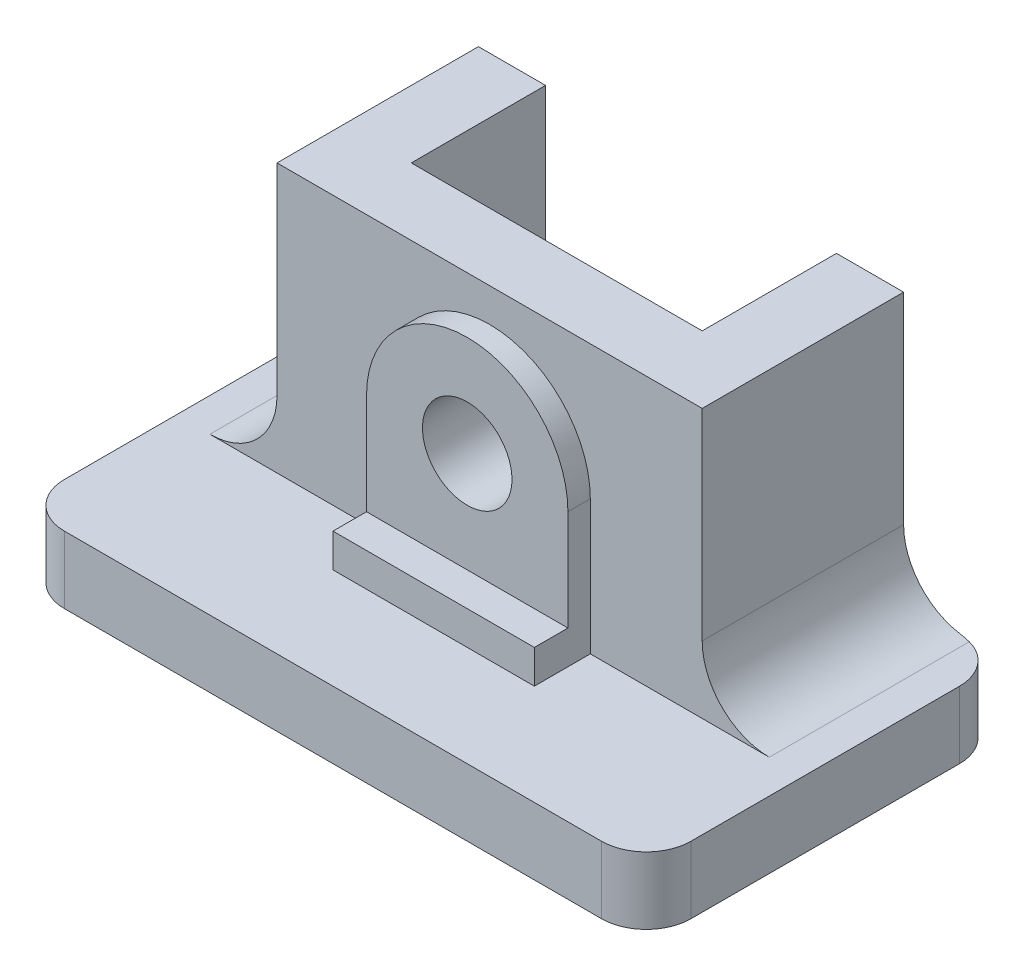
ISO-10303-21;
HEADER;
FILE_DESCRIPTION(('STEP AP214'),'2;1');
FILE_NAME('part.step','',(''),(''),'','','');
FILE_SCHEMA(('AUTOMOTIVE_DESIGN { 1 0 10303 214 1 1 1 1 }'));
ENDSEC;
DATA;
#1=APPLICATION_CONTEXT('core data for automotive mechanical design processes');
#2=APPLICATION_PROTOCOL_DEFINITION('international standard','automotive_design',2000,#1);
#3=PRODUCT_CONTEXT('',#1,'mechanical');
#4=PRODUCT('Part','Part','',(#3));
#5=PRODUCT_RELATED_PRODUCT_CATEGORY('part','',(#4));
#6=PRODUCT_DEFINITION_FORMATION('','',#4);
#7=PRODUCT_DEFINITION_CONTEXT('part definition',#1,'design');
#8=PRODUCT_DEFINITION('design','',#6,#7);
#9=PRODUCT_DEFINITION_SHAPE('','',#8);
#10=(LENGTH_UNIT() NAMED_UNIT(*) SI_UNIT(.MILLI.,.METRE.));
#11=(NAMED_UNIT(*) PLANE_ANGLE_UNIT() SI_UNIT($,.RADIAN.));
#12=(NAMED_UNIT(*) SI_UNIT($,.STERADIAN.) SOLID_ANGLE_UNIT());
#13=UNCERTAINTY_MEASURE_WITH_UNIT(LENGTH_MEASURE(1.E-05),#10,'distance_accuracy_value','');
#14=(GEOMETRIC_REPRESENTATION_CONTEXT(3) GLOBAL_UNCERTAINTY_ASSIGNED_CONTEXT((#13)) GLOBAL_UNIT_ASSIGNED_CONTEXT((#10,
#11,#12)) REPRESENTATION_CONTEXT('',''));
#15=CARTESIAN_POINT('',(0.,0.,0.));
#16=DIRECTION('',(0.,0.,1.));
#17=DIRECTION('',(1.,0.,0.));
#18=AXIS2_PLACEMENT_3D('',#15,#16,#17);
#19=CARTESIAN_POINT('',(0.,9.525,50.8));
#20=DIRECTION('',(0.,-1.,0.));
#21=DIRECTION('',(0.,0.,-1.));
#22=AXIS2_PLACEMENT_3D('',#19,#20,#21);
#23=PLANE('',#22);
#24=DIRECTION('',(0.,0.,-1.));
#25=VECTOR('',#24,1.);
#26=CARTESIAN_POINT('',(-84.1375,9.525,50.8));
#27=LINE('',#26,#25);
#28=CARTESIAN_POINT('',(-84.1375,9.525,28.575));
#29=VERTEX_POINT('',#28);
#30=CARTESIAN_POINT('',(-84.1375,9.525,0.201638937895729));
#31=VERTEX_POINT('',#30);
#32=EDGE_CURVE('E327',#29,#31,#27,.T.);
#33=ORIENTED_EDGE('',*,*,#32,.T.);
#34=CARTESIAN_POINT('',(-82.55,9.525,6.35));
#35=DIRECTION('',(0.,-1.,0.));
#36=DIRECTION('',(0.,0.,-1.));
#37=AXIS2_PLACEMENT_3D('',#34,#35,#36);
#38=CIRCLE('',#37,6.35);
#39=CARTESIAN_POINT('',(-88.9,9.525,6.35));
#40=VERTEX_POINT('',#39);
#41=EDGE_CURVE('E412',#31,#40,#38,.F.);
#42=ORIENTED_EDGE('',*,*,#41,.T.);
#43=DIRECTION('',(0.,0.,-1.));
#44=VECTOR('',#43,1.);
#45=CARTESIAN_POINT('',(-88.9,9.525,50.8));
#46=LINE('',#45,#44);
#47=CARTESIAN_POINT('',(-88.9,9.525,44.45));
#48=VERTEX_POINT('',#47);
#49=EDGE_CURVE('E324',#48,#40,#46,.T.);
#50=ORIENTED_EDGE('',*,*,#49,.F.);
#51=CARTESIAN_POINT('',(-82.55,9.525,44.45));
#52=DIRECTION('',(0.,-1.,0.));
#53=DIRECTION('',(0.,0.,-1.));
#54=AXIS2_PLACEMENT_3D('',#51,#52,#53);
#55=CIRCLE('',#54,6.35);
#56=CARTESIAN_POINT('',(-82.55,9.525,50.8));
#57=VERTEX_POINT('',#56);
#58=EDGE_CURVE('E414',#48,#57,#55,.F.);
#59=ORIENTED_EDGE('',*,*,#58,.T.);
#60=DIRECTION('',(-1.,0.,0.));
#61=VECTOR('',#60,1.);
#62=CARTESIAN_POINT('',(-88.9,9.525,50.8));
#63=LINE('',#62,#61);
#64=CARTESIAN_POINT('',(-6.34999999999999,9.525,50.8));
#65=VERTEX_POINT('',#64);
#66=EDGE_CURVE('E238',#65,#57,#63,.T.);
#67=ORIENTED_EDGE('',*,*,#66,.F.);
#68=CARTESIAN_POINT('',(-6.35,9.525,44.45));
#69=DIRECTION('',(0.,-1.,0.));
#70=DIRECTION('',(0.,0.,-1.));
#71=AXIS2_PLACEMENT_3D('',#68,#69,#70);
#72=CIRCLE('',#71,6.35);
#73=CARTESIAN_POINT('',(0.,9.525,44.45));
#74=VERTEX_POINT('',#73);
#75=EDGE_CURVE('E415',#65,#74,#72,.F.);
#76=ORIENTED_EDGE('',*,*,#75,.T.);
#77=DIRECTION('',(0.,0.,-1.));
#78=VECTOR('',#77,1.);
#79=CARTESIAN_POINT('',(0.,9.525,50.8));
#80=LINE('',#79,#78);
#81=CARTESIAN_POINT('',(0.,9.525,6.35));
#82=VERTEX_POINT('',#81);
#83=EDGE_CURVE('E339',#74,#82,#80,.T.);
#84=ORIENTED_EDGE('',*,*,#83,.T.);
#85=CARTESIAN_POINT('',(-6.35,9.525,6.35));
#86=DIRECTION('',(0.,-1.,0.));
#87=DIRECTION('',(0.,0.,-1.));
#88=AXIS2_PLACEMENT_3D('',#85,#86,#87);
#89=CIRCLE('',#88,6.35);
#90=CARTESIAN_POINT('',(-4.76249999999999,9.525,0.20163893789573));
#91=VERTEX_POINT('',#90);
#92=EDGE_CURVE('E58',#82,#91,#89,.F.);
#93=ORIENTED_EDGE('',*,*,#92,.T.);
#94=DIRECTION('',(0.,0.,-1.));
#95=VECTOR('',#94,1.);
#96=CARTESIAN_POINT('',(-4.76249999999999,9.525,50.8));
#97=LINE('',#96,#95);
#98=CARTESIAN_POINT('',(-4.76249999999999,9.525,28.575));
#99=VERTEX_POINT('',#98);
#100=EDGE_CURVE('E337',#99,#91,#97,.T.);
#101=ORIENTED_EDGE('',*,*,#100,.F.);
#102=DIRECTION('',(-1.,0.,0.));
#103=VECTOR('',#102,1.);
#104=CARTESIAN_POINT('',(-88.9,9.525,28.575));
#105=LINE('',#104,#103);
#106=CARTESIAN_POINT('',(-30.1625,9.525,28.575));
#107=VERTEX_POINT('',#106);
#108=EDGE_CURVE('E239',#99,#107,#105,.T.);
#109=ORIENTED_EDGE('',*,*,#108,.T.);
#110=DIRECTION('',(0.,0.,-1.));
#111=VECTOR('',#110,1.);
#112=CARTESIAN_POINT('',(-30.1625,9.52500000000001,31.75));
#113=LINE('',#112,#111);
#114=CARTESIAN_POINT('',(-30.1625,9.525,36.5125));
#115=VERTEX_POINT('',#114);
#116=EDGE_CURVE('E223',#115,#107,#113,.T.);
#117=ORIENTED_EDGE('',*,*,#116,.F.);
#118=DIRECTION('',(1.,0.,0.));
#119=VECTOR('',#118,1.);
#120=CARTESIAN_POINT('',(-58.7375,9.525,36.5125));
#121=LINE('',#120,#119);
#122=CARTESIAN_POINT('',(-58.7375,9.525,36.5125));
#123=VERTEX_POINT('',#122);
#124=EDGE_CURVE('E214',#123,#115,#121,.T.);
#125=ORIENTED_EDGE('',*,*,#124,.F.);
#126=DIRECTION('',(0.,0.,-1.));
#127=VECTOR('',#126,1.);
#128=CARTESIAN_POINT('',(-58.7375,9.525,31.75));
#129=LINE('',#128,#127);
#130=CARTESIAN_POINT('',(-58.7375,9.525,28.575));
#131=VERTEX_POINT('',#130);
#132=EDGE_CURVE('E199',#123,#131,#129,.T.);
#133=ORIENTED_EDGE('',*,*,#132,.T.);
#134=EDGE_CURVE('E234',#131,#29,#105,.T.);
#135=ORIENTED_EDGE('',*,*,#134,.T.);
#136=EDGE_LOOP('',(#33,#42,#50,#59,#67,#76,#84,#93,#101,#109,#117,#125,#133,#135));
#137=FACE_BOUND('',#136,.T.);
#138=ADVANCED_FACE('F35',(#137),#23,.F.);
#139=CARTESIAN_POINT('',(0.,0.,31.75));
#140=DIRECTION('',(0.,0.,1.));
#141=DIRECTION('',(1.,0.,0.));
#142=AXIS2_PLACEMENT_3D('',#139,#140,#141);
#143=PLANE('',#142);
#144=CARTESIAN_POINT('',(-44.45,28.575,31.75));
#145=DIRECTION('',(0.,0.,1.));
#146=DIRECTION('',(1.,0.,0.));
#147=AXIS2_PLACEMENT_3D('',#144,#145,#146);
#148=CIRCLE('',#147,6.35);
#149=CARTESIAN_POINT('',(-38.1,28.575,31.75));
#150=VERTEX_POINT('',#149);
#151=EDGE_CURVE('E209',#150,#150,#148,.T.);
#152=ORIENTED_EDGE('',*,*,#151,.F.);
#153=EDGE_LOOP('',(#152));
#154=FACE_BOUND('',#153,.T.);
#155=DIRECTION('',(0.,-1.,0.));
#156=VECTOR('',#155,1.);
#157=CARTESIAN_POINT('',(-58.7375,0.,31.75));
#158=LINE('',#157,#156);
#159=CARTESIAN_POINT('',(-58.7375,28.575,31.75));
#160=VERTEX_POINT('',#159);
#161=CARTESIAN_POINT('',(-58.7375,14.2875,31.75));
#162=VERTEX_POINT('',#161);
#163=EDGE_CURVE('E249',#160,#162,#158,.T.);
#164=ORIENTED_EDGE('',*,*,#163,.T.);
#165=DIRECTION('',(-1.,0.,0.));
#166=VECTOR('',#165,1.);
#167=CARTESIAN_POINT('',(-58.7375,14.2875,31.75));
#168=LINE('',#167,#166);
#169=CARTESIAN_POINT('',(-30.1625,14.2875,31.75));
#170=VERTEX_POINT('',#169);
#171=EDGE_CURVE('E219',#170,#162,#168,.T.);
#172=ORIENTED_EDGE('',*,*,#171,.F.);
#173=DIRECTION('',(0.,-1.,0.));
#174=VECTOR('',#173,1.);
#175=CARTESIAN_POINT('',(-30.1625,0.,31.75));
#176=LINE('',#175,#174);
#177=CARTESIAN_POINT('',(-30.1625,28.575,31.75));
#178=VERTEX_POINT('',#177);
#179=EDGE_CURVE('E244',#178,#170,#176,.T.);
#180=ORIENTED_EDGE('',*,*,#179,.F.);
#181=CARTESIAN_POINT('',(-44.45,28.575,31.75));
#182=DIRECTION('',(0.,0.,1.));
#183=DIRECTION('',(1.,0.,0.));
#184=AXIS2_PLACEMENT_3D('',#181,#182,#183);
#185=CIRCLE('',#184,14.2875);
#186=EDGE_CURVE('E247',#178,#160,#185,.T.);
#187=ORIENTED_EDGE('',*,*,#186,.T.);
#188=EDGE_LOOP('',(#164,#172,#180,#187));
#189=FACE_BOUND('',#188,.T.);
#190=ADVANCED_FACE('F477',(#154,#189),#143,.T.);
#191=CARTESIAN_POINT('',(-88.9,0.,28.575));
#192=DIRECTION('',(0.,0.,-1.));
#193=DIRECTION('',(-1.,0.,0.));
#194=AXIS2_PLACEMENT_3D('',#191,#192,#193);
#195=PLANE('',#194);
#196=ORIENTED_EDGE('',*,*,#108,.F.);
#197=CARTESIAN_POINT('',(-4.76249999999999,19.05,28.575));
#198=DIRECTION('',(0.,0.,-1.));
#199=DIRECTION('',(-1.,0.,0.));
#200=AXIS2_PLACEMENT_3D('',#197,#198,#199);
#201=CIRCLE('',#200,9.525);
#202=CARTESIAN_POINT('',(-14.2875,19.05,28.575));
#203=VERTEX_POINT('',#202);
#204=EDGE_CURVE('E275',#99,#203,#201,.T.);
#205=ORIENTED_EDGE('',*,*,#204,.T.);
#206=DIRECTION('',(0.,1.,0.));
#207=VECTOR('',#206,1.);
#208=CARTESIAN_POINT('',(-14.2875,0.,28.575));
#209=LINE('',#208,#207);
#210=CARTESIAN_POINT('',(-14.2875,47.625,28.575));
#211=VERTEX_POINT('',#210);
#212=EDGE_CURVE('E273',#203,#211,#209,.T.);
#213=ORIENTED_EDGE('',*,*,#212,.T.);
#214=DIRECTION('',(-1.,0.,0.));
#215=VECTOR('',#214,1.);
#216=CARTESIAN_POINT('',(-88.9,47.625,28.575));
#217=LINE('',#216,#215);
#218=CARTESIAN_POINT('',(-74.6125,47.625,28.575));
#219=VERTEX_POINT('',#218);
#220=EDGE_CURVE('E265',#211,#219,#217,.T.);
#221=ORIENTED_EDGE('',*,*,#220,.T.);
#222=DIRECTION('',(0.,1.,0.));
#223=VECTOR('',#222,1.);
#224=CARTESIAN_POINT('',(-74.6125,0.,28.575));
#225=LINE('',#224,#223);
#226=CARTESIAN_POINT('',(-74.6125,19.05,28.575));
#227=VERTEX_POINT('',#226);
#228=EDGE_CURVE('E270',#227,#219,#225,.T.);
#229=ORIENTED_EDGE('',*,*,#228,.F.);
#230=CARTESIAN_POINT('',(-84.1375,19.05,28.575));
#231=DIRECTION('',(0.,0.,-1.));
#232=DIRECTION('',(-1.,0.,0.));
#233=AXIS2_PLACEMENT_3D('',#230,#231,#232);
#234=CIRCLE('',#233,9.525);
#235=EDGE_CURVE('E267',#29,#227,#234,.F.);
#236=ORIENTED_EDGE('',*,*,#235,.F.);
#237=ORIENTED_EDGE('',*,*,#134,.F.);
#238=DIRECTION('',(0.,-1.,0.));
#239=VECTOR('',#238,1.);
#240=CARTESIAN_POINT('',(-58.7375,0.,28.575));
#241=LINE('',#240,#239);
#242=CARTESIAN_POINT('',(-58.7375,28.575,28.575));
#243=VERTEX_POINT('',#242);
#244=EDGE_CURVE('E205',#243,#131,#241,.T.);
#245=ORIENTED_EDGE('',*,*,#244,.F.);
#246=CARTESIAN_POINT('',(-44.45,28.575,28.575));
#247=DIRECTION('',(0.,0.,1.));
#248=DIRECTION('',(1.,0.,0.));
#249=AXIS2_PLACEMENT_3D('',#246,#247,#248);
#250=CIRCLE('',#249,14.2875);
#251=CARTESIAN_POINT('',(-30.1625,28.575,28.575));
#252=VERTEX_POINT('',#251);
#253=EDGE_CURVE('E256',#252,#243,#250,.T.);
#254=ORIENTED_EDGE('',*,*,#253,.F.);
#255=DIRECTION('',(0.,-1.,0.));
#256=VECTOR('',#255,1.);
#257=CARTESIAN_POINT('',(-30.1625,0.,28.575));
#258=LINE('',#257,#256);
#259=EDGE_CURVE('E242',#252,#107,#258,.T.);
#260=ORIENTED_EDGE('',*,*,#259,.T.);
#261=EDGE_LOOP('',(#196,#205,#213,#221,#229,#236,#237,#245,#254,#260));
#262=FACE_BOUND('',#261,.T.);
#263=ADVANCED_FACE('F481',(#262),#195,.F.);
#264=CARTESIAN_POINT('',(0.,0.,0.));
#265=DIRECTION('',(0.,0.,1.));
#266=DIRECTION('',(1.,0.,0.));
#267=AXIS2_PLACEMENT_3D('',#264,#265,#266);
#268=PLANE('',#267);
#269=DIRECTION('',(1.,0.,0.));
#270=VECTOR('',#269,1.);
#271=CARTESIAN_POINT('',(0.,0.,0.));
#272=LINE('',#271,#270);
#273=CARTESIAN_POINT('',(-82.55,0.,0.));
#274=VERTEX_POINT('',#273);
#275=CARTESIAN_POINT('',(-65.0875,0.,0.));
#276=VERTEX_POINT('',#275);
#277=EDGE_CURVE('E304',#274,#276,#272,.T.);
#278=ORIENTED_EDGE('',*,*,#277,.F.);
#279=DIRECTION('',(0.,-1.,0.));
#280=VECTOR('',#279,1.);
#281=CARTESIAN_POINT('',(-82.55,0.,0.));
#282=LINE('',#281,#280);
#283=CARTESIAN_POINT('',(-82.55,9.65822334432936,0.));
#284=VERTEX_POINT('',#283);
#285=EDGE_CURVE('E357',#274,#284,#282,.F.);
#286=ORIENTED_EDGE('',*,*,#285,.T.);
#287=CARTESIAN_POINT('',(-84.1375,19.05,0.));
#288=DIRECTION('',(0.,0.,1.));
#289=DIRECTION('',(1.,0.,0.));
#290=AXIS2_PLACEMENT_3D('',#287,#288,#289);
#291=CIRCLE('',#290,9.525);
#292=CARTESIAN_POINT('',(-74.6125,19.05,0.));
#293=VERTEX_POINT('',#292);
#294=EDGE_CURVE('E318',#293,#284,#291,.F.);
#295=ORIENTED_EDGE('',*,*,#294,.F.);
#296=DIRECTION('',(0.,-1.,0.));
#297=VECTOR('',#296,1.);
#298=CARTESIAN_POINT('',(-74.6125,0.,0.));
#299=LINE('',#298,#297);
#300=CARTESIAN_POINT('',(-74.6125,47.625,0.));
#301=VERTEX_POINT('',#300);
#302=EDGE_CURVE('E315',#301,#293,#299,.T.);
#303=ORIENTED_EDGE('',*,*,#302,.F.);
#304=DIRECTION('',(1.,0.,0.));
#305=VECTOR('',#304,1.);
#306=CARTESIAN_POINT('',(0.,47.625,0.));
#307=LINE('',#306,#305);
#308=CARTESIAN_POINT('',(-65.0875,47.625,0.));
#309=VERTEX_POINT('',#308);
#310=EDGE_CURVE('E312',#301,#309,#307,.T.);
#311=ORIENTED_EDGE('',*,*,#310,.T.);
#312=DIRECTION('',(0.,1.,0.));
#313=VECTOR('',#312,1.);
#314=CARTESIAN_POINT('',(-65.0875,0.,0.));
#315=LINE('',#314,#313);
#316=EDGE_CURVE('E295',#276,#309,#315,.T.);
#317=ORIENTED_EDGE('',*,*,#316,.F.);
#318=EDGE_LOOP('',(#278,#286,#295,#303,#311,#317));
#319=FACE_BOUND('',#318,.T.);
#320=ADVANCED_FACE('F448',(#319),#268,.F.);
#321=CARTESIAN_POINT('',(0.,0.,50.8));
#322=DIRECTION('',(0.,1.,0.));
#323=DIRECTION('',(0.,0.,1.));
#324=AXIS2_PLACEMENT_3D('',#321,#322,#323);
#325=PLANE('',#324);
#326=DIRECTION('',(0.,0.,-1.));
#327=VECTOR('',#326,1.);
#328=CARTESIAN_POINT('',(-88.9,0.,50.8));
#329=LINE('',#328,#327);
#330=CARTESIAN_POINT('',(-88.9,0.,44.45));
#331=VERTEX_POINT('',#330);
#332=CARTESIAN_POINT('',(-88.9,0.,6.35));
#333=VERTEX_POINT('',#332);
#334=EDGE_CURVE('E321',#331,#333,#329,.T.);
#335=ORIENTED_EDGE('',*,*,#334,.T.);
#336=CARTESIAN_POINT('',(-82.55,0.,6.35));
#337=DIRECTION('',(0.,1.,0.));
#338=DIRECTION('',(0.,0.,1.));
#339=AXIS2_PLACEMENT_3D('',#336,#337,#338);
#340=CIRCLE('',#339,6.35);
#341=EDGE_CURVE('E355',#333,#274,#340,.F.);
#342=ORIENTED_EDGE('',*,*,#341,.T.);
#343=ORIENTED_EDGE('',*,*,#277,.T.);
#344=DIRECTION('',(0.,0.,1.));
#345=VECTOR('',#344,1.);
#346=CARTESIAN_POINT('',(-65.0875,0.,0.));
#347=LINE('',#346,#345);
#348=CARTESIAN_POINT('',(-65.0875,0.,19.05));
#349=VERTEX_POINT('',#348);
#350=EDGE_CURVE('E278',#276,#349,#347,.T.);
#351=ORIENTED_EDGE('',*,*,#350,.T.);
#352=DIRECTION('',(1.,0.,0.));
#353=VECTOR('',#352,1.);
#354=CARTESIAN_POINT('',(-65.0875,0.,19.05));
#355=LINE('',#354,#353);
#356=CARTESIAN_POINT('',(-23.8125,0.,19.05));
#357=VERTEX_POINT('',#356);
#358=EDGE_CURVE('E281',#349,#357,#355,.T.);
#359=ORIENTED_EDGE('',*,*,#358,.T.);
#360=DIRECTION('',(0.,0.,-1.));
#361=VECTOR('',#360,1.);
#362=CARTESIAN_POINT('',(-23.8125,0.,0.));
#363=LINE('',#362,#361);
#364=CARTESIAN_POINT('',(-23.8125,0.,0.));
#365=VERTEX_POINT('',#364);
#366=EDGE_CURVE('E285',#357,#365,#363,.T.);
#367=ORIENTED_EDGE('',*,*,#366,.T.);
#368=CARTESIAN_POINT('',(-6.35,0.,0.));
#369=VERTEX_POINT('',#368);
#370=EDGE_CURVE('E297',#365,#369,#272,.T.);
#371=ORIENTED_EDGE('',*,*,#370,.T.);
#372=CARTESIAN_POINT('',(-6.35,0.,6.35));
#373=DIRECTION('',(0.,1.,0.));
#374=DIRECTION('',(0.,0.,1.));
#375=AXIS2_PLACEMENT_3D('',#372,#373,#374);
#376=CIRCLE('',#375,6.35);
#377=CARTESIAN_POINT('',(0.,0.,6.35));
#378=VERTEX_POINT('',#377);
#379=EDGE_CURVE('E349',#369,#378,#376,.F.);
#380=ORIENTED_EDGE('',*,*,#379,.T.);
#381=DIRECTION('',(0.,0.,-1.));
#382=VECTOR('',#381,1.);
#383=CARTESIAN_POINT('',(0.,0.,50.8));
#384=LINE('',#383,#382);
#385=CARTESIAN_POINT('',(0.,0.,44.45));
#386=VERTEX_POINT('',#385);
#387=EDGE_CURVE('E341',#386,#378,#384,.T.);
#388=ORIENTED_EDGE('',*,*,#387,.F.);
#389=CARTESIAN_POINT('',(-6.35,0.,44.45));
#390=DIRECTION('',(0.,1.,0.));
#391=DIRECTION('',(0.,0.,1.));
#392=AXIS2_PLACEMENT_3D('',#389,#390,#391);
#393=CIRCLE('',#392,6.35);
#394=CARTESIAN_POINT('',(-6.34999999999999,0.,50.8));
#395=VERTEX_POINT('',#394);
#396=EDGE_CURVE('E351',#386,#395,#393,.F.);
#397=ORIENTED_EDGE('',*,*,#396,.T.);
#398=DIRECTION('',(1.,0.,0.));
#399=VECTOR('',#398,1.);
#400=CARTESIAN_POINT('',(-88.9,0.,50.8));
#401=LINE('',#400,#399);
#402=CARTESIAN_POINT('',(-82.55,0.,50.8));
#403=VERTEX_POINT('',#402);
#404=EDGE_CURVE('E235',#403,#395,#401,.T.);
#405=ORIENTED_EDGE('',*,*,#404,.F.);
#406=CARTESIAN_POINT('',(-82.55,0.,44.45));
#407=DIRECTION('',(0.,1.,0.));
#408=DIRECTION('',(0.,0.,1.));
#409=AXIS2_PLACEMENT_3D('',#406,#407,#408);
#410=CIRCLE('',#409,6.35);
#411=EDGE_CURVE('E353',#403,#331,#410,.F.);
#412=ORIENTED_EDGE('',*,*,#411,.T.);
#413=EDGE_LOOP('',(#335,#342,#343,#351,#359,#367,#371,#380,#388,#397,#405,#412));
#414=FACE_BOUND('',#413,.T.);
#415=ADVANCED_FACE('F428',(#414),#325,.F.);
#416=CARTESIAN_POINT('',(0.,0.,50.8));
#417=DIRECTION('',(1.,0.,0.));
#418=DIRECTION('',(0.,1.,0.));
#419=AXIS2_PLACEMENT_3D('',#416,#417,#418);
#420=PLANE('',#419);
#421=ORIENTED_EDGE('',*,*,#83,.F.);
#422=DIRECTION('',(0.,1.,0.));
#423=VECTOR('',#422,1.);
#424=CARTESIAN_POINT('',(0.,0.,44.45));
#425=LINE('',#424,#423);
#426=EDGE_CURVE('E402',#74,#386,#425,.F.);
#427=ORIENTED_EDGE('',*,*,#426,.T.);
#428=ORIENTED_EDGE('',*,*,#387,.T.);
#429=DIRECTION('',(0.,-1.,0.));
#430=VECTOR('',#429,1.);
#431=CARTESIAN_POINT('',(0.,9.525,6.35));
#432=LINE('',#431,#430);
#433=EDGE_CURVE('E404',#378,#82,#432,.F.);
#434=ORIENTED_EDGE('',*,*,#433,.T.);
#435=EDGE_LOOP('',(#421,#427,#428,#434));
#436=FACE_BOUND('',#435,.T.);
#437=ADVANCED_FACE('F395',(#436),#420,.T.);
#438=CARTESIAN_POINT('',(-4.76249999999999,19.05,50.8));
#439=DIRECTION('',(0.,0.,-1.));
#440=DIRECTION('',(-1.,0.,0.));
#441=AXIS2_PLACEMENT_3D('',#438,#439,#440);
#442=CYLINDRICAL_SURFACE('',#441,9.525);
#443=ORIENTED_EDGE('',*,*,#100,.T.);
#444=CARTESIAN_POINT('',(-4.76249999999999,9.525,0.20163893789573));
#445=CARTESIAN_POINT('',(-4.89292842954271,9.52498377923927,0.167946005353614));
#446=CARTESIAN_POINT('',(-5.02444082954333,9.52767904090494,0.138433284963938));
#447=CARTESIAN_POINT('',(-5.28809556049949,9.53860645353962,0.087993903837918));
#448=CARTESIAN_POINT('',(-5.42023003054187,9.54680696328974,0.0670192712376514));
#449=CARTESIAN_POINT('',(-5.68509533288884,9.56885549900046,0.033496104243662));
#450=CARTESIAN_POINT('',(-5.81782616525393,9.58270352553383,0.0209475707045315));
#451=CARTESIAN_POINT('',(-6.08386751021251,9.61613702105669,0.00416749227032797));
#452=CARTESIAN_POINT('',(-6.21717698515402,9.63575491851342,-1.59727596285902E-05));
#453=CARTESIAN_POINT('',(-6.35,9.65822334432936,0.));
#454=B_SPLINE_CURVE_WITH_KNOTS('',3,(#444,#445,#446,#447,#448,#449,#450,#451,#452,#453),
.UNSPECIFIED.,.F.,.F.,(4,2,2,2,4),(0.,0.404040283946994,0.805778018629562,1.20751579405719,
1.61155607371614),.UNSPECIFIED.);
#455=CARTESIAN_POINT('',(-6.35,9.65822334432936,0.));
#456=VERTEX_POINT('',#455);
#457=EDGE_CURVE('E11',#91,#456,#454,.T.);
#458=ORIENTED_EDGE('',*,*,#457,.T.);
#459=CARTESIAN_POINT('',(-4.76249999999999,19.05,0.));
#460=DIRECTION('',(0.,0.,1.));
#461=DIRECTION('',(1.,0.,0.));
#462=AXIS2_PLACEMENT_3D('',#459,#460,#461);
#463=CIRCLE('',#462,9.525);
#464=CARTESIAN_POINT('',(-14.2875,19.05,0.));
#465=VERTEX_POINT('',#464);
#466=EDGE_CURVE('E306',#465,#456,#463,.T.);
#467=ORIENTED_EDGE('',*,*,#466,.F.);
#468=DIRECTION('',(0.,0.,-1.));
#469=VECTOR('',#468,1.);
#470=CARTESIAN_POINT('',(-14.2875,19.05,50.8));
#471=LINE('',#470,#469);
#472=EDGE_CURVE('E335',#203,#465,#471,.T.);
#473=ORIENTED_EDGE('',*,*,#472,.F.);
#474=ORIENTED_EDGE('',*,*,#204,.F.);
#475=EDGE_LOOP('',(#443,#458,#467,#473,#474));
#476=FACE_BOUND('',#475,.T.);
#477=ADVANCED_FACE('F390',(#476),#442,.F.);
#478=CARTESIAN_POINT('',(-14.2875,0.,50.8));
#479=DIRECTION('',(1.,0.,0.));
#480=DIRECTION('',(0.,1.,0.));
#481=AXIS2_PLACEMENT_3D('',#478,#479,#480);
#482=PLANE('',#481);
#483=ORIENTED_EDGE('',*,*,#212,.F.);
#484=ORIENTED_EDGE('',*,*,#472,.T.);
#485=DIRECTION('',(0.,-1.,0.));
#486=VECTOR('',#485,1.);
#487=CARTESIAN_POINT('',(-14.2875,0.,0.));
#488=LINE('',#487,#486);
#489=CARTESIAN_POINT('',(-14.2875,47.625,0.));
#490=VERTEX_POINT('',#489);
#491=EDGE_CURVE('E308',#490,#465,#488,.T.);
#492=ORIENTED_EDGE('',*,*,#491,.F.);
#493=DIRECTION('',(0.,0.,-1.));
#494=VECTOR('',#493,1.);
#495=CARTESIAN_POINT('',(-14.2875,47.625,50.8));
#496=LINE('',#495,#494);
#497=EDGE_CURVE('E333',#211,#490,#496,.T.);
#498=ORIENTED_EDGE('',*,*,#497,.F.);
#499=EDGE_LOOP('',(#483,#484,#492,#498));
#500=FACE_BOUND('',#499,.T.);
#501=ADVANCED_FACE('F386',(#500),#482,.T.);
#502=CARTESIAN_POINT('',(0.,47.625,50.8));
#503=DIRECTION('',(0.,1.,0.));
#504=DIRECTION('',(0.,0.,1.));
#505=AXIS2_PLACEMENT_3D('',#502,#503,#504);
#506=PLANE('',#505);
#507=ORIENTED_EDGE('',*,*,#220,.F.);
#508=ORIENTED_EDGE('',*,*,#497,.T.);
#509=CARTESIAN_POINT('',(-23.8125,47.625,0.));
#510=VERTEX_POINT('',#509);
#511=EDGE_CURVE('E311',#510,#490,#307,.T.);
#512=ORIENTED_EDGE('',*,*,#511,.F.);
#513=DIRECTION('',(0.,0.,-1.));
#514=VECTOR('',#513,1.);
#515=CARTESIAN_POINT('',(-23.8125,47.625,0.));
#516=LINE('',#515,#514);
#517=CARTESIAN_POINT('',(-23.8125,47.625,19.05));
#518=VERTEX_POINT('',#517);
#519=EDGE_CURVE('E282',#518,#510,#516,.T.);
#520=ORIENTED_EDGE('',*,*,#519,.F.);
#521=DIRECTION('',(1.,0.,0.));
#522=VECTOR('',#521,1.);
#523=CARTESIAN_POINT('',(-65.0875,47.625,19.05));
#524=LINE('',#523,#522);
#525=CARTESIAN_POINT('',(-65.0875,47.625,19.05));
#526=VERTEX_POINT('',#525);
#527=EDGE_CURVE('E291',#526,#518,#524,.T.);
#528=ORIENTED_EDGE('',*,*,#527,.F.);
#529=DIRECTION('',(0.,0.,1.));
#530=VECTOR('',#529,1.);
#531=CARTESIAN_POINT('',(-65.0875,47.625,0.));
#532=LINE('',#531,#530);
#533=EDGE_CURVE('E277',#309,#526,#532,.T.);
#534=ORIENTED_EDGE('',*,*,#533,.F.);
#535=ORIENTED_EDGE('',*,*,#310,.F.);
#536=DIRECTION('',(0.,0.,-1.));
#537=VECTOR('',#536,1.);
#538=CARTESIAN_POINT('',(-74.6125,47.625,50.8));
#539=LINE('',#538,#537);
#540=EDGE_CURVE('E331',#219,#301,#539,.T.);
#541=ORIENTED_EDGE('',*,*,#540,.F.);
#542=EDGE_LOOP('',(#507,#508,#512,#520,#528,#534,#535,#541));
#543=FACE_BOUND('',#542,.T.);
#544=ADVANCED_FACE('F382',(#543),#506,.T.);
#545=CARTESIAN_POINT('',(-74.6125,0.,50.8));
#546=DIRECTION('',(1.,0.,0.));
#547=DIRECTION('',(0.,0.,-1.));
#548=AXIS2_PLACEMENT_3D('',#545,#546,#547);
#549=PLANE('',#548);
#550=DIRECTION('',(0.,0.,-1.));
#551=VECTOR('',#550,1.);
#552=CARTESIAN_POINT('',(-74.6125,19.05,50.8));
#553=LINE('',#552,#551);
#554=EDGE_CURVE('E329',#227,#293,#553,.T.);
#555=ORIENTED_EDGE('',*,*,#554,.F.);
#556=ORIENTED_EDGE('',*,*,#228,.T.);
#557=ORIENTED_EDGE('',*,*,#540,.T.);
#558=ORIENTED_EDGE('',*,*,#302,.T.);
#559=EDGE_LOOP('',(#555,#556,#557,#558));
#560=FACE_BOUND('',#559,.T.);
#561=ADVANCED_FACE('F377',(#560),#549,.F.);
#562=CARTESIAN_POINT('',(-84.1375,19.05,50.8));
#563=DIRECTION('',(0.,0.,-1.));
#564=DIRECTION('',(-1.,0.,0.));
#565=AXIS2_PLACEMENT_3D('',#562,#563,#564);
#566=CYLINDRICAL_SURFACE('',#565,9.525);
#567=ORIENTED_EDGE('',*,*,#294,.T.);
#568=CARTESIAN_POINT('',(-82.55,9.65822334432936,0.));
#569=CARTESIAN_POINT('',(-82.682823014846,9.63575491851342,-1.59727596281791E-05));
#570=CARTESIAN_POINT('',(-82.8161324897875,9.61613702105669,0.00416749227032836));
#571=CARTESIAN_POINT('',(-83.0821738347461,9.58270352553382,0.0209475707045318));
#572=CARTESIAN_POINT('',(-83.2149046671112,9.56885549900045,0.0334961042436626));
#573=CARTESIAN_POINT('',(-83.4797699694581,9.54680696328974,0.0670192712376533));
#574=CARTESIAN_POINT('',(-83.6119044395005,9.53860645353962,0.0879939038379206));
#575=CARTESIAN_POINT('',(-83.8755591704567,9.52767904090494,0.13843328496394));
#576=CARTESIAN_POINT('',(-84.0070715704573,9.52498377923927,0.167946005353615));
#577=CARTESIAN_POINT('',(-84.1375,9.525,0.201638937895729));
#578=B_SPLINE_CURVE_WITH_KNOTS('',3,(#568,#569,#570,#571,#572,#573,#574,#575,#576,#577),
.UNSPECIFIED.,.F.,.F.,(4,2,2,2,4),(0.,0.404040279658943,0.805778055086575,1.20751578976914,
1.61155607371613),.UNSPECIFIED.);
#579=EDGE_CURVE('E359',#284,#31,#578,.T.);
#580=ORIENTED_EDGE('',*,*,#579,.T.);
#581=ORIENTED_EDGE('',*,*,#32,.F.);
#582=ORIENTED_EDGE('',*,*,#235,.T.);
#583=ORIENTED_EDGE('',*,*,#554,.T.);
#584=EDGE_LOOP('',(#567,#580,#581,#582,#583));
#585=FACE_BOUND('',#584,.T.);
#586=ADVANCED_FACE('F371',(#585),#566,.F.);
#587=CARTESIAN_POINT('',(-88.9,0.,50.8));
#588=DIRECTION('',(1.,0.,0.));
#589=DIRECTION('',(0.,1.,0.));
#590=AXIS2_PLACEMENT_3D('',#587,#588,#589);
#591=PLANE('',#590);
#592=ORIENTED_EDGE('',*,*,#49,.T.);
#593=DIRECTION('',(0.,-1.,0.));
#594=VECTOR('',#593,1.);
#595=CARTESIAN_POINT('',(-88.9,0.,6.35));
#596=LINE('',#595,#594);
#597=EDGE_CURVE('E346',#40,#333,#596,.T.);
#598=ORIENTED_EDGE('',*,*,#597,.T.);
#599=ORIENTED_EDGE('',*,*,#334,.F.);
#600=DIRECTION('',(0.,-1.,0.));
#601=VECTOR('',#600,1.);
#602=CARTESIAN_POINT('',(-88.9,0.,44.45));
#603=LINE('',#602,#601);
#604=EDGE_CURVE('E344',#331,#48,#603,.F.);
#605=ORIENTED_EDGE('',*,*,#604,.T.);
#606=EDGE_LOOP('',(#592,#598,#599,#605));
#607=FACE_BOUND('',#606,.T.);
#608=ADVANCED_FACE('F376',(#607),#591,.F.);
#609=ORIENTED_EDGE('',*,*,#466,.T.);
#610=DIRECTION('',(0.,-1.,0.));
#611=VECTOR('',#610,1.);
#612=CARTESIAN_POINT('',(-6.35,0.,0.));
#613=LINE('',#612,#611);
#614=EDGE_CURVE('E45',#456,#369,#613,.T.);
#615=ORIENTED_EDGE('',*,*,#614,.T.);
#616=ORIENTED_EDGE('',*,*,#370,.F.);
#617=DIRECTION('',(0.,1.,0.));
#618=VECTOR('',#617,1.);
#619=CARTESIAN_POINT('',(-23.8125,0.,0.));
#620=LINE('',#619,#618);
#621=EDGE_CURVE('E298',#365,#510,#620,.T.);
#622=ORIENTED_EDGE('',*,*,#621,.T.);
#623=ORIENTED_EDGE('',*,*,#511,.T.);
#624=ORIENTED_EDGE('',*,*,#491,.T.);
#625=EDGE_LOOP('',(#609,#615,#616,#622,#623,#624));
#626=FACE_BOUND('',#625,.T.);
#627=ADVANCED_FACE('F468',(#626),#268,.F.);
#628=CARTESIAN_POINT('',(-65.0875,0.,0.));
#629=DIRECTION('',(-1.,0.,0.));
#630=DIRECTION('',(0.,0.,1.));
#631=AXIS2_PLACEMENT_3D('',#628,#629,#630);
#632=PLANE('',#631);
#633=ORIENTED_EDGE('',*,*,#533,.T.);
#634=DIRECTION('',(0.,1.,0.));
#635=VECTOR('',#634,1.);
#636=CARTESIAN_POINT('',(-65.0875,0.,19.05));
#637=LINE('',#636,#635);
#638=EDGE_CURVE('E288',#349,#526,#637,.T.);
#639=ORIENTED_EDGE('',*,*,#638,.F.);
#640=ORIENTED_EDGE('',*,*,#350,.F.);
#641=ORIENTED_EDGE('',*,*,#316,.T.);
#642=EDGE_LOOP('',(#633,#639,#640,#641));
#643=FACE_BOUND('',#642,.T.);
#644=ADVANCED_FACE('F454',(#643),#632,.F.);
#645=CARTESIAN_POINT('',(-23.8125,0.,0.));
#646=DIRECTION('',(1.,0.,0.));
#647=DIRECTION('',(0.,0.,-1.));
#648=AXIS2_PLACEMENT_3D('',#645,#646,#647);
#649=PLANE('',#648);
#650=ORIENTED_EDGE('',*,*,#519,.T.);
#651=ORIENTED_EDGE('',*,*,#621,.F.);
#652=ORIENTED_EDGE('',*,*,#366,.F.);
#653=DIRECTION('',(0.,1.,0.));
#654=VECTOR('',#653,1.);
#655=CARTESIAN_POINT('',(-23.8125,0.,19.05));
#656=LINE('',#655,#654);
#657=EDGE_CURVE('E301',#357,#518,#656,.T.);
#658=ORIENTED_EDGE('',*,*,#657,.T.);
#659=EDGE_LOOP('',(#650,#651,#652,#658));
#660=FACE_BOUND('',#659,.T.);
#661=ADVANCED_FACE('F508',(#660),#649,.F.);
#662=CARTESIAN_POINT('',(-65.0875,0.,19.05));
#663=DIRECTION('',(0.,0.,1.));
#664=DIRECTION('',(1.,0.,0.));
#665=AXIS2_PLACEMENT_3D('',#662,#663,#664);
#666=PLANE('',#665);
#667=CARTESIAN_POINT('',(-44.45,28.575,19.05));
#668=DIRECTION('',(0.,0.,1.));
#669=DIRECTION('',(1.,0.,0.));
#670=AXIS2_PLACEMENT_3D('',#667,#668,#669);
#671=CIRCLE('',#670,6.35);
#672=CARTESIAN_POINT('',(-38.1,28.575,19.05));
#673=VERTEX_POINT('',#672);
#674=EDGE_CURVE('E40',#673,#673,#671,.T.);
#675=ORIENTED_EDGE('',*,*,#674,.T.);
#676=EDGE_LOOP('',(#675));
#677=FACE_BOUND('',#676,.T.);
#678=ORIENTED_EDGE('',*,*,#527,.T.);
#679=ORIENTED_EDGE('',*,*,#657,.F.);
#680=ORIENTED_EDGE('',*,*,#358,.F.);
#681=ORIENTED_EDGE('',*,*,#638,.T.);
#682=EDGE_LOOP('',(#678,#679,#680,#681));
#683=FACE_BOUND('',#682,.T.);
#684=ADVANCED_FACE('F461',(#677,#683),#666,.F.);
#685=CARTESIAN_POINT('',(-30.1625,0.,31.75));
#686=DIRECTION('',(1.,0.,0.));
#687=DIRECTION('',(0.,1.,0.));
#688=AXIS2_PLACEMENT_3D('',#685,#686,#687);
#689=PLANE('',#688);
#690=ORIENTED_EDGE('',*,*,#259,.F.);
#691=DIRECTION('',(0.,0.,-1.));
#692=VECTOR('',#691,1.);
#693=CARTESIAN_POINT('',(-30.1625,28.575,31.75));
#694=LINE('',#693,#692);
#695=EDGE_CURVE('E261',#178,#252,#694,.T.);
#696=ORIENTED_EDGE('',*,*,#695,.F.);
#697=ORIENTED_EDGE('',*,*,#179,.T.);
#698=DIRECTION('',(0.,0.,-1.));
#699=VECTOR('',#698,1.);
#700=CARTESIAN_POINT('',(-30.1625,14.2875,36.5125));
#701=LINE('',#700,#699);
#702=CARTESIAN_POINT('',(-30.1625,14.2875,36.5125));
#703=VERTEX_POINT('',#702);
#704=EDGE_CURVE('E232',#703,#170,#701,.T.);
#705=ORIENTED_EDGE('',*,*,#704,.F.);
#706=DIRECTION('',(0.,1.,0.));
#707=VECTOR('',#706,1.);
#708=CARTESIAN_POINT('',(-30.1625,9.525,36.5125));
#709=LINE('',#708,#707);
#710=EDGE_CURVE('E224',#115,#703,#709,.T.);
#711=ORIENTED_EDGE('',*,*,#710,.F.);
#712=ORIENTED_EDGE('',*,*,#116,.T.);
#713=EDGE_LOOP('',(#690,#696,#697,#705,#711,#712));
#714=FACE_BOUND('',#713,.T.);
#715=ADVANCED_FACE('F503',(#714),#689,.T.);
#716=CARTESIAN_POINT('',(-44.45,28.575,31.75));
#717=DIRECTION('',(0.,0.,-1.));
#718=DIRECTION('',(-1.,0.,0.));
#719=AXIS2_PLACEMENT_3D('',#716,#717,#718);
#720=CYLINDRICAL_SURFACE('',#719,14.2875);
#721=ORIENTED_EDGE('',*,*,#253,.T.);
#722=DIRECTION('',(0.,0.,-1.));
#723=VECTOR('',#722,1.);
#724=CARTESIAN_POINT('',(-58.7375,28.575,31.75));
#725=LINE('',#724,#723);
#726=EDGE_CURVE('E208',#160,#243,#725,.T.);
#727=ORIENTED_EDGE('',*,*,#726,.F.);
#728=ORIENTED_EDGE('',*,*,#186,.F.);
#729=ORIENTED_EDGE('',*,*,#695,.T.);
#730=EDGE_LOOP('',(#721,#727,#728,#729));
#731=FACE_BOUND('',#730,.T.);
#732=ADVANCED_FACE('F500',(#731),#720,.T.);
#733=CARTESIAN_POINT('',(-58.7375,0.,31.75));
#734=DIRECTION('',(1.,0.,0.));
#735=DIRECTION('',(0.,0.,-1.));
#736=AXIS2_PLACEMENT_3D('',#733,#734,#735);
#737=PLANE('',#736);
#738=ORIENTED_EDGE('',*,*,#244,.T.);
#739=ORIENTED_EDGE('',*,*,#132,.F.);
#740=DIRECTION('',(0.,-1.,0.));
#741=VECTOR('',#740,1.);
#742=CARTESIAN_POINT('',(-58.7375,9.525,36.5125));
#743=LINE('',#742,#741);
#744=CARTESIAN_POINT('',(-58.7375,14.2875,36.5125));
#745=VERTEX_POINT('',#744);
#746=EDGE_CURVE('E203',#745,#123,#743,.T.);
#747=ORIENTED_EDGE('',*,*,#746,.F.);
#748=DIRECTION('',(0.,0.,-1.));
#749=VECTOR('',#748,1.);
#750=CARTESIAN_POINT('',(-58.7375,14.2875,36.5125));
#751=LINE('',#750,#749);
#752=EDGE_CURVE('E229',#745,#162,#751,.T.);
#753=ORIENTED_EDGE('',*,*,#752,.T.);
#754=ORIENTED_EDGE('',*,*,#163,.F.);
#755=ORIENTED_EDGE('',*,*,#726,.T.);
#756=EDGE_LOOP('',(#738,#739,#747,#753,#754,#755));
#757=FACE_BOUND('',#756,.T.);
#758=ADVANCED_FACE('F201',(#757),#737,.F.);
#759=CARTESIAN_POINT('',(-44.45,28.575,31.75));
#760=DIRECTION('',(0.,0.,-1.));
#761=DIRECTION('',(-1.,0.,0.));
#762=AXIS2_PLACEMENT_3D('',#759,#760,#761);
#763=CYLINDRICAL_SURFACE('',#762,6.35);
#764=ORIENTED_EDGE('',*,*,#151,.T.);
#765=EDGE_LOOP('',(#764));
#766=FACE_BOUND('',#765,.T.);
#767=ORIENTED_EDGE('',*,*,#674,.F.);
#768=EDGE_LOOP('',(#767));
#769=FACE_BOUND('',#768,.T.);
#770=ADVANCED_FACE('F494',(#766,#769),#763,.F.);
#771=CARTESIAN_POINT('',(0.,0.,50.8));
#772=DIRECTION('',(0.,0.,-1.));
#773=DIRECTION('',(-1.,0.,0.));
#774=AXIS2_PLACEMENT_3D('',#771,#772,#773);
#775=PLANE('',#774);
#776=ORIENTED_EDGE('',*,*,#66,.T.);
#777=DIRECTION('',(0.,-1.,0.));
#778=VECTOR('',#777,1.);
#779=CARTESIAN_POINT('',(-82.55,0.,50.8));
#780=LINE('',#779,#778);
#781=EDGE_CURVE('E406',#57,#403,#780,.T.);
#782=ORIENTED_EDGE('',*,*,#781,.T.);
#783=ORIENTED_EDGE('',*,*,#404,.T.);
#784=DIRECTION('',(0.,1.,0.));
#785=VECTOR('',#784,1.);
#786=CARTESIAN_POINT('',(-6.35,9.525,50.8));
#787=LINE('',#786,#785);
#788=EDGE_CURVE('E409',#395,#65,#787,.T.);
#789=ORIENTED_EDGE('',*,*,#788,.T.);
#790=EDGE_LOOP('',(#776,#782,#783,#789));
#791=FACE_BOUND('',#790,.T.);
#792=ADVANCED_FACE('F430',(#791),#775,.F.);
#793=CARTESIAN_POINT('',(-58.7375,14.2875,36.5125));
#794=DIRECTION('',(0.,-1.,0.));
#795=DIRECTION('',(0.,0.,-1.));
#796=AXIS2_PLACEMENT_3D('',#793,#794,#795);
#797=PLANE('',#796);
#798=ORIENTED_EDGE('',*,*,#171,.T.);
#799=ORIENTED_EDGE('',*,*,#752,.F.);
#800=DIRECTION('',(-1.,0.,0.));
#801=VECTOR('',#800,1.);
#802=CARTESIAN_POINT('',(-58.7375,14.2875,36.5125));
#803=LINE('',#802,#801);
#804=EDGE_CURVE('E217',#703,#745,#803,.T.);
#805=ORIENTED_EDGE('',*,*,#804,.F.);
#806=ORIENTED_EDGE('',*,*,#704,.T.);
#807=EDGE_LOOP('',(#798,#799,#805,#806));
#808=FACE_BOUND('',#807,.T.);
#809=ADVANCED_FACE('F563',(#808),#797,.F.);
#810=CARTESIAN_POINT('',(0.,0.,36.5125));
#811=DIRECTION('',(0.,0.,-1.));
#812=DIRECTION('',(-1.,0.,0.));
#813=AXIS2_PLACEMENT_3D('',#810,#811,#812);
#814=PLANE('',#813);
#815=ORIENTED_EDGE('',*,*,#746,.T.);
#816=ORIENTED_EDGE('',*,*,#124,.T.);
#817=ORIENTED_EDGE('',*,*,#710,.T.);
#818=ORIENTED_EDGE('',*,*,#804,.T.);
#819=EDGE_LOOP('',(#815,#816,#817,#818));
#820=FACE_BOUND('',#819,.T.);
#821=ADVANCED_FACE('F213',(#820),#814,.F.);
#822=CARTESIAN_POINT('',(-82.55,0.,6.35));
#823=DIRECTION('',(0.,-1.,0.));
#824=DIRECTION('',(1.,0.,0.));
#825=AXIS2_PLACEMENT_3D('',#822,#823,#824);
#826=CYLINDRICAL_SURFACE('',#825,6.35);
#827=ORIENTED_EDGE('',*,*,#579,.F.);
#828=ORIENTED_EDGE('',*,*,#285,.F.);
#829=ORIENTED_EDGE('',*,*,#341,.F.);
#830=ORIENTED_EDGE('',*,*,#597,.F.);
#831=ORIENTED_EDGE('',*,*,#41,.F.);
#832=EDGE_LOOP('',(#827,#828,#829,#830,#831));
#833=FACE_BOUND('',#832,.T.);
#834=ADVANCED_FACE('F367',(#833),#826,.T.);
#835=CARTESIAN_POINT('',(-82.55,0.,44.45));
#836=DIRECTION('',(0.,-1.,0.));
#837=DIRECTION('',(1.,0.,0.));
#838=AXIS2_PLACEMENT_3D('',#835,#836,#837);
#839=CYLINDRICAL_SURFACE('',#838,6.35);
#840=ORIENTED_EDGE('',*,*,#58,.F.);
#841=ORIENTED_EDGE('',*,*,#604,.F.);
#842=ORIENTED_EDGE('',*,*,#411,.F.);
#843=ORIENTED_EDGE('',*,*,#781,.F.);
#844=EDGE_LOOP('',(#840,#841,#842,#843));
#845=FACE_BOUND('',#844,.T.);
#846=ADVANCED_FACE('F434',(#845),#839,.T.);
#847=CARTESIAN_POINT('',(-6.35,0.,44.45));
#848=DIRECTION('',(0.,-1.,0.));
#849=DIRECTION('',(1.,0.,0.));
#850=AXIS2_PLACEMENT_3D('',#847,#848,#849);
#851=CYLINDRICAL_SURFACE('',#850,6.35);
#852=ORIENTED_EDGE('',*,*,#396,.F.);
#853=ORIENTED_EDGE('',*,*,#426,.F.);
#854=ORIENTED_EDGE('',*,*,#75,.F.);
#855=ORIENTED_EDGE('',*,*,#788,.F.);
#856=EDGE_LOOP('',(#852,#853,#854,#855));
#857=FACE_BOUND('',#856,.T.);
#858=ADVANCED_FACE('F425',(#857),#851,.T.);
#859=CARTESIAN_POINT('',(-6.35,0.,6.35));
#860=DIRECTION('',(0.,1.,0.));
#861=DIRECTION('',(-1.,0.,0.));
#862=AXIS2_PLACEMENT_3D('',#859,#860,#861);
#863=CYLINDRICAL_SURFACE('',#862,6.35);
#864=ORIENTED_EDGE('',*,*,#92,.F.);
#865=ORIENTED_EDGE('',*,*,#433,.F.);
#866=ORIENTED_EDGE('',*,*,#379,.F.);
#867=ORIENTED_EDGE('',*,*,#614,.F.);
#868=ORIENTED_EDGE('',*,*,#457,.F.);
#869=EDGE_LOOP('',(#864,#865,#866,#867,#868));
#870=FACE_BOUND('',#869,.T.);
#871=ADVANCED_FACE('F37',(#870),#863,.T.);
#872=CLOSED_SHELL('',(#138,#190,#263,#320,#415,#437,#477,#501,#544,#561,#586,#608,#627,#644,
#661,#684,#715,#732,#758,#770,#792,#809,#821,#834,#846,#858,#871));
#873=MANIFOLD_SOLID_BREP('B2',#872);
#874=ADVANCED_BREP_SHAPE_REPRESENTATION('',(#18,#873),#14);
#875=SHAPE_DEFINITION_REPRESENTATION(#9,#874);
ENDSEC;
END-ISO-10303-21;
